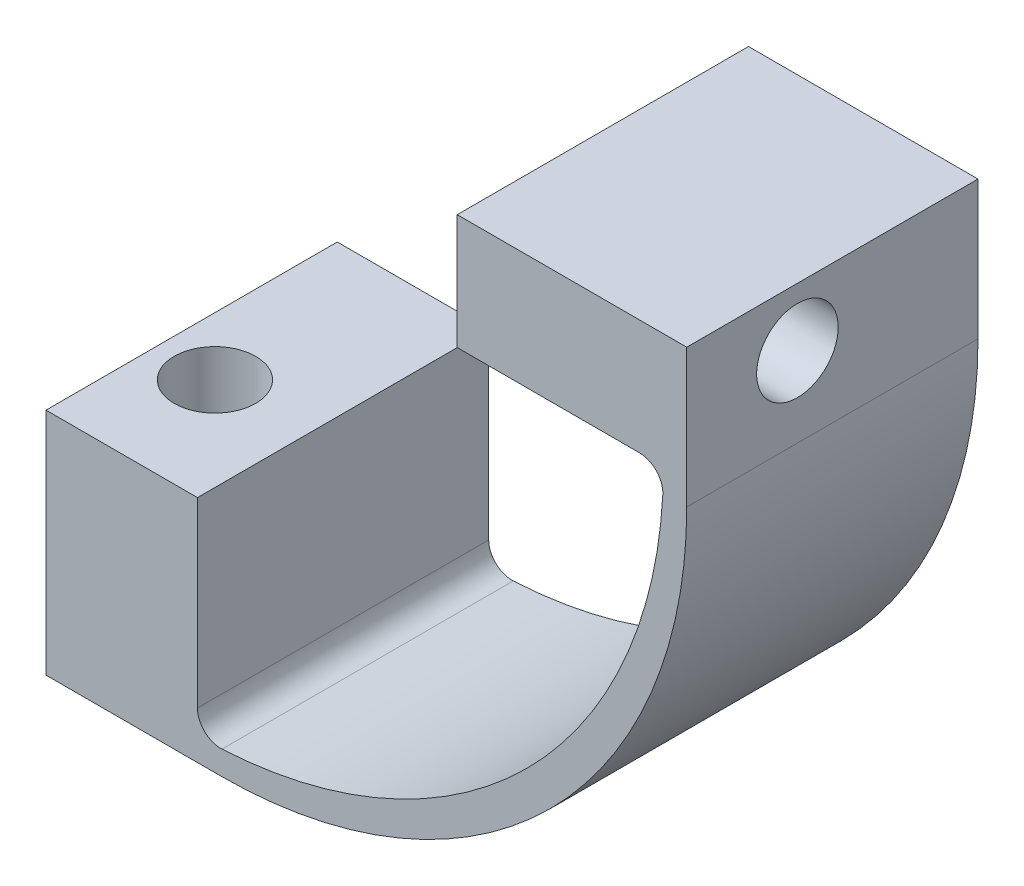
ISO-10303-21;
HEADER;
FILE_DESCRIPTION(('STEP AP214'),'2;1');
FILE_NAME('part.step','',(''),(''),'','','');
FILE_SCHEMA(('AUTOMOTIVE_DESIGN { 1 0 10303 214 1 1 1 1 }'));
ENDSEC;
DATA;
#1=APPLICATION_CONTEXT('core data for automotive mechanical design processes');
#2=APPLICATION_PROTOCOL_DEFINITION('international standard','automotive_design',2000,#1);
#3=PRODUCT_CONTEXT('',#1,'mechanical');
#4=PRODUCT('Part','Part','',(#3));
#5=PRODUCT_RELATED_PRODUCT_CATEGORY('part','',(#4));
#6=PRODUCT_DEFINITION_FORMATION('','',#4);
#7=PRODUCT_DEFINITION_CONTEXT('part definition',#1,'design');
#8=PRODUCT_DEFINITION('design','',#6,#7);
#9=PRODUCT_DEFINITION_SHAPE('','',#8);
#10=(LENGTH_UNIT() NAMED_UNIT(*) SI_UNIT(.MILLI.,.METRE.));
#11=(NAMED_UNIT(*) PLANE_ANGLE_UNIT() SI_UNIT($,.RADIAN.));
#12=(NAMED_UNIT(*) SI_UNIT($,.STERADIAN.) SOLID_ANGLE_UNIT());
#13=UNCERTAINTY_MEASURE_WITH_UNIT(LENGTH_MEASURE(1.E-05),#10,'distance_accuracy_value','');
#14=(GEOMETRIC_REPRESENTATION_CONTEXT(3) GLOBAL_UNCERTAINTY_ASSIGNED_CONTEXT((#13)) GLOBAL_UNIT_ASSIGNED_CONTEXT((#10,
#11,#12)) REPRESENTATION_CONTEXT('',''));
#15=CARTESIAN_POINT('',(0.,0.,0.));
#16=DIRECTION('',(0.,0.,1.));
#17=DIRECTION('',(1.,0.,0.));
#18=AXIS2_PLACEMENT_3D('',#15,#16,#17);
#19=CARTESIAN_POINT('',(0.,0.,0.));
#20=DIRECTION('',(0.,-1.,0.));
#21=DIRECTION('',(0.,0.,-1.));
#22=AXIS2_PLACEMENT_3D('',#19,#20,#21);
#23=PLANE('',#22);
#24=DIRECTION('',(-1.,0.,0.));
#25=VECTOR('',#24,1.);
#26=CARTESIAN_POINT('',(50.,0.,-15.5));
#27=LINE('',#26,#25);
#28=CARTESIAN_POINT('',(10.,0.,-15.5));
#29=VERTEX_POINT('',#28);
#30=CARTESIAN_POINT('',(-5.,0.,-15.5));
#31=VERTEX_POINT('',#30);
#32=EDGE_CURVE('E187',#29,#31,#27,.T.);
#33=ORIENTED_EDGE('',*,*,#32,.F.);
#34=DIRECTION('',(0.,0.,-1.));
#35=VECTOR('',#34,1.);
#36=CARTESIAN_POINT('',(10.,0.,9.49999999999999));
#37=LINE('',#36,#35);
#38=CARTESIAN_POINT('',(10.,0.,9.5));
#39=VERTEX_POINT('',#38);
#40=EDGE_CURVE('E208',#29,#39,#37,.F.);
#41=ORIENTED_EDGE('',*,*,#40,.T.);
#42=DIRECTION('',(1.,0.,0.));
#43=VECTOR('',#42,1.);
#44=CARTESIAN_POINT('',(50.,0.,9.49999999999999));
#45=LINE('',#44,#43);
#46=CARTESIAN_POINT('',(-5.,0.,9.5));
#47=VERTEX_POINT('',#46);
#48=EDGE_CURVE('E191',#47,#39,#45,.T.);
#49=ORIENTED_EDGE('',*,*,#48,.F.);
#50=DIRECTION('',(0.,0.,1.));
#51=VECTOR('',#50,1.);
#52=CARTESIAN_POINT('',(-5.,0.,-15.5));
#53=LINE('',#52,#51);
#54=EDGE_CURVE('E189',#31,#47,#53,.T.);
#55=ORIENTED_EDGE('',*,*,#54,.F.);
#56=EDGE_LOOP('',(#33,#41,#49,#55));
#57=FACE_BOUND('',#56,.T.);
#58=CARTESIAN_POINT('',(0.,0.,0.));
#59=DIRECTION('',(0.,1.,0.));
#60=DIRECTION('',(0.,0.,1.));
#61=AXIS2_PLACEMENT_3D('',#58,#59,#60);
#62=CIRCLE('',#61,3.5);
#63=CARTESIAN_POINT('',(0.,0.,3.5));
#64=VERTEX_POINT('',#63);
#65=EDGE_CURVE('E183',#64,#64,#62,.T.);
#66=ORIENTED_EDGE('',*,*,#65,.T.);
#67=EDGE_LOOP('',(#66));
#68=FACE_BOUND('',#67,.T.);
#69=ADVANCED_FACE('F35',(#57,#68),#23,.T.);
#70=CARTESIAN_POINT('',(50.,2.,-15.5));
#71=DIRECTION('',(-1.,0.,0.));
#72=DIRECTION('',(0.,0.,1.));
#73=AXIS2_PLACEMENT_3D('',#70,#71,#72);
#74=PLANE('',#73);
#75=DIRECTION('',(0.,-1.,0.));
#76=VECTOR('',#75,1.);
#77=CARTESIAN_POINT('',(50.,2.,9.49999999999999));
#78=LINE('',#77,#76);
#79=CARTESIAN_POINT('',(50.,51.88,9.5));
#80=VERTEX_POINT('',#79);
#81=CARTESIAN_POINT('',(50.,40.,9.49999999999999));
#82=VERTEX_POINT('',#81);
#83=EDGE_CURVE('E194',#80,#82,#78,.T.);
#84=ORIENTED_EDGE('',*,*,#83,.T.);
#85=DIRECTION('',(0.,0.,-1.));
#86=VECTOR('',#85,1.);
#87=CARTESIAN_POINT('',(50.,40.,-15.5));
#88=LINE('',#87,#86);
#89=CARTESIAN_POINT('',(50.,40.,-15.5));
#90=VERTEX_POINT('',#89);
#91=EDGE_CURVE('E205',#82,#90,#88,.T.);
#92=ORIENTED_EDGE('',*,*,#91,.T.);
#93=DIRECTION('',(0.,-1.,0.));
#94=VECTOR('',#93,1.);
#95=CARTESIAN_POINT('',(50.,2.,-15.5));
#96=LINE('',#95,#94);
#97=CARTESIAN_POINT('',(50.,51.88,-15.5));
#98=VERTEX_POINT('',#97);
#99=EDGE_CURVE('E203',#98,#90,#96,.T.);
#100=ORIENTED_EDGE('',*,*,#99,.F.);
#101=DIRECTION('',(0.,0.,1.));
#102=VECTOR('',#101,1.);
#103=CARTESIAN_POINT('',(50.,51.88,9.5));
#104=LINE('',#103,#102);
#105=EDGE_CURVE('E176',#98,#80,#104,.T.);
#106=ORIENTED_EDGE('',*,*,#105,.T.);
#107=EDGE_LOOP('',(#84,#92,#100,#106));
#108=FACE_BOUND('',#107,.T.);
#109=CARTESIAN_POINT('',(50.,46.88,0.));
#110=DIRECTION('',(1.,0.,0.));
#111=DIRECTION('',(0.,0.,-1.));
#112=AXIS2_PLACEMENT_3D('',#109,#110,#111);
#113=CIRCLE('',#112,3.5);
#114=CARTESIAN_POINT('',(50.,46.88,-3.5));
#115=VERTEX_POINT('',#114);
#116=EDGE_CURVE('E173',#115,#115,#113,.T.);
#117=ORIENTED_EDGE('',*,*,#116,.F.);
#118=EDGE_LOOP('',(#117));
#119=FACE_BOUND('',#118,.T.);
#120=ADVANCED_FACE('F256',(#108,#119),#74,.F.);
#121=CARTESIAN_POINT('',(50.,2.,-15.5));
#122=DIRECTION('',(0.,0.,1.));
#123=DIRECTION('',(1.,0.,0.));
#124=AXIS2_PLACEMENT_3D('',#121,#122,#123);
#125=PLANE('',#124);
#126=ORIENTED_EDGE('',*,*,#99,.T.);
#127=CARTESIAN_POINT('',(10.,40.,-15.5));
#128=DIRECTION('',(0.,0.,1.));
#129=DIRECTION('',(1.,0.,0.));
#130=AXIS2_PLACEMENT_3D('',#127,#128,#129);
#131=CIRCLE('',#130,40.);
#132=EDGE_CURVE('E214',#90,#29,#131,.F.);
#133=ORIENTED_EDGE('',*,*,#132,.T.);
#134=ORIENTED_EDGE('',*,*,#32,.T.);
#135=DIRECTION('',(0.,-1.,0.));
#136=VECTOR('',#135,1.);
#137=CARTESIAN_POINT('',(-5.,2.,-15.5));
#138=LINE('',#137,#136);
#139=CARTESIAN_POINT('',(-5.,19.7,-15.5));
#140=VERTEX_POINT('',#139);
#141=EDGE_CURVE('E200',#140,#31,#138,.T.);
#142=ORIENTED_EDGE('',*,*,#141,.F.);
#143=DIRECTION('',(-1.,0.,0.));
#144=VECTOR('',#143,1.);
#145=CARTESIAN_POINT('',(-5.,19.7,-15.5));
#146=LINE('',#145,#144);
#147=CARTESIAN_POINT('',(8.,19.7,-15.5));
#148=VERTEX_POINT('',#147);
#149=EDGE_CURVE('E165',#148,#140,#146,.T.);
#150=ORIENTED_EDGE('',*,*,#149,.F.);
#151=DIRECTION('',(0.,-1.,0.));
#152=VECTOR('',#151,1.);
#153=CARTESIAN_POINT('',(8.,19.7,-15.5));
#154=LINE('',#153,#152);
#155=CARTESIAN_POINT('',(8.,4.05266807797945,-15.5));
#156=VERTEX_POINT('',#155);
#157=EDGE_CURVE('E168',#148,#156,#154,.T.);
#158=ORIENTED_EDGE('',*,*,#157,.T.);
#159=CARTESIAN_POINT('',(10.,4.05266807797945,-15.5));
#160=DIRECTION('',(0.,0.,1.));
#161=DIRECTION('',(1.,0.,0.));
#162=AXIS2_PLACEMENT_3D('',#159,#160,#161);
#163=CIRCLE('',#162,2.);
#164=CARTESIAN_POINT('',(10.1052631578947,2.05544008208363,-15.5));
#165=VERTEX_POINT('',#164);
#166=EDGE_CURVE('E43',#156,#165,#163,.T.);
#167=ORIENTED_EDGE('',*,*,#166,.T.);
#168=CARTESIAN_POINT('',(8.,42.,-15.5));
#169=DIRECTION('',(0.,0.,1.));
#170=DIRECTION('',(1.,0.,0.));
#171=AXIS2_PLACEMENT_3D('',#168,#169,#170);
#172=CIRCLE('',#171,40.);
#173=CARTESIAN_POINT('',(47.9445599179164,39.8947368421053,-15.5));
#174=VERTEX_POINT('',#173);
#175=EDGE_CURVE('E210',#165,#174,#172,.T.);
#176=ORIENTED_EDGE('',*,*,#175,.T.);
#177=CARTESIAN_POINT('',(45.9473319220206,40.,-15.5));
#178=DIRECTION('',(0.,0.,1.));
#179=DIRECTION('',(1.,0.,0.));
#180=AXIS2_PLACEMENT_3D('',#177,#178,#179);
#181=CIRCLE('',#180,2.);
#182=CARTESIAN_POINT('',(45.9473319220206,42.,-15.5));
#183=VERTEX_POINT('',#182);
#184=EDGE_CURVE('E150',#174,#183,#181,.T.);
#185=ORIENTED_EDGE('',*,*,#184,.T.);
#186=DIRECTION('',(1.,0.,0.));
#187=VECTOR('',#186,1.);
#188=CARTESIAN_POINT('',(30.3,42.,-15.5));
#189=LINE('',#188,#187);
#190=CARTESIAN_POINT('',(30.3,42.,-15.5));
#191=VERTEX_POINT('',#190);
#192=EDGE_CURVE('E128',#191,#183,#189,.T.);
#193=ORIENTED_EDGE('',*,*,#192,.F.);
#194=DIRECTION('',(0.,-1.,0.));
#195=VECTOR('',#194,1.);
#196=CARTESIAN_POINT('',(30.3,51.88,-15.5));
#197=LINE('',#196,#195);
#198=CARTESIAN_POINT('',(30.3,51.88,-15.5));
#199=VERTEX_POINT('',#198);
#200=EDGE_CURVE('E136',#199,#191,#197,.T.);
#201=ORIENTED_EDGE('',*,*,#200,.F.);
#202=DIRECTION('',(1.,0.,0.));
#203=VECTOR('',#202,1.);
#204=CARTESIAN_POINT('',(48.,51.88,-15.5));
#205=LINE('',#204,#203);
#206=EDGE_CURVE('E179',#199,#98,#205,.T.);
#207=ORIENTED_EDGE('',*,*,#206,.T.);
#208=EDGE_LOOP('',(#126,#133,#134,#142,#150,#158,#167,#176,#185,#193,#201,#207));
#209=FACE_BOUND('',#208,.T.);
#210=ADVANCED_FACE('F148',(#209),#125,.F.);
#211=CARTESIAN_POINT('',(-5.,2.,-15.5));
#212=DIRECTION('',(1.,0.,0.));
#213=DIRECTION('',(0.,0.,-1.));
#214=AXIS2_PLACEMENT_3D('',#211,#212,#213);
#215=PLANE('',#214);
#216=ORIENTED_EDGE('',*,*,#54,.T.);
#217=DIRECTION('',(0.,-1.,0.));
#218=VECTOR('',#217,1.);
#219=CARTESIAN_POINT('',(-5.,2.,9.5));
#220=LINE('',#219,#218);
#221=CARTESIAN_POINT('',(-5.,19.7,9.5));
#222=VERTEX_POINT('',#221);
#223=EDGE_CURVE('E197',#222,#47,#220,.T.);
#224=ORIENTED_EDGE('',*,*,#223,.F.);
#225=DIRECTION('',(0.,0.,1.));
#226=VECTOR('',#225,1.);
#227=CARTESIAN_POINT('',(-5.,19.7,-15.5));
#228=LINE('',#227,#226);
#229=EDGE_CURVE('E154',#140,#222,#228,.T.);
#230=ORIENTED_EDGE('',*,*,#229,.F.);
#231=ORIENTED_EDGE('',*,*,#141,.T.);
#232=EDGE_LOOP('',(#216,#224,#230,#231));
#233=FACE_BOUND('',#232,.T.);
#234=ADVANCED_FACE('F243',(#233),#215,.F.);
#235=CARTESIAN_POINT('',(50.,2.,9.49999999999999));
#236=DIRECTION('',(0.,0.,-1.));
#237=DIRECTION('',(-1.,0.,0.));
#238=AXIS2_PLACEMENT_3D('',#235,#236,#237);
#239=PLANE('',#238);
#240=ORIENTED_EDGE('',*,*,#48,.T.);
#241=CARTESIAN_POINT('',(10.,40.,9.5));
#242=DIRECTION('',(0.,0.,-1.));
#243=DIRECTION('',(-1.,0.,0.));
#244=AXIS2_PLACEMENT_3D('',#241,#242,#243);
#245=CIRCLE('',#244,40.);
#246=EDGE_CURVE('E216',#39,#82,#245,.F.);
#247=ORIENTED_EDGE('',*,*,#246,.T.);
#248=ORIENTED_EDGE('',*,*,#83,.F.);
#249=DIRECTION('',(1.,0.,0.));
#250=VECTOR('',#249,1.);
#251=CARTESIAN_POINT('',(48.,51.88,9.5));
#252=LINE('',#251,#250);
#253=CARTESIAN_POINT('',(30.3,51.88,9.5));
#254=VERTEX_POINT('',#253);
#255=EDGE_CURVE('E180',#254,#80,#252,.T.);
#256=ORIENTED_EDGE('',*,*,#255,.F.);
#257=DIRECTION('',(0.,1.,0.));
#258=VECTOR('',#257,1.);
#259=CARTESIAN_POINT('',(30.3,51.88,9.5));
#260=LINE('',#259,#258);
#261=CARTESIAN_POINT('',(30.3,42.,9.5));
#262=VERTEX_POINT('',#261);
#263=EDGE_CURVE('E135',#262,#254,#260,.T.);
#264=ORIENTED_EDGE('',*,*,#263,.F.);
#265=DIRECTION('',(1.,0.,0.));
#266=VECTOR('',#265,1.);
#267=CARTESIAN_POINT('',(30.3,42.,9.5));
#268=LINE('',#267,#266);
#269=CARTESIAN_POINT('',(45.9473319220206,42.,9.5));
#270=VERTEX_POINT('',#269);
#271=EDGE_CURVE('E131',#262,#270,#268,.T.);
#272=ORIENTED_EDGE('',*,*,#271,.T.);
#273=CARTESIAN_POINT('',(45.9473319220206,40.,9.49999999999999));
#274=DIRECTION('',(0.,0.,-1.));
#275=DIRECTION('',(-1.,0.,0.));
#276=AXIS2_PLACEMENT_3D('',#273,#274,#275);
#277=CIRCLE('',#276,2.);
#278=CARTESIAN_POINT('',(47.9445599179164,39.8947368421053,9.49999999999999));
#279=VERTEX_POINT('',#278);
#280=EDGE_CURVE('E223',#270,#279,#277,.T.);
#281=ORIENTED_EDGE('',*,*,#280,.T.);
#282=CARTESIAN_POINT('',(8.,42.,9.5));
#283=DIRECTION('',(0.,0.,-1.));
#284=DIRECTION('',(-1.,0.,0.));
#285=AXIS2_PLACEMENT_3D('',#282,#283,#284);
#286=CIRCLE('',#285,40.);
#287=CARTESIAN_POINT('',(10.1052631578947,2.05544008208363,9.5));
#288=VERTEX_POINT('',#287);
#289=EDGE_CURVE('E212',#279,#288,#286,.T.);
#290=ORIENTED_EDGE('',*,*,#289,.T.);
#291=CARTESIAN_POINT('',(10.,4.05266807797945,9.5));
#292=DIRECTION('',(0.,0.,-1.));
#293=DIRECTION('',(-1.,0.,0.));
#294=AXIS2_PLACEMENT_3D('',#291,#292,#293);
#295=CIRCLE('',#294,2.);
#296=CARTESIAN_POINT('',(8.,4.05266807797945,9.5));
#297=VERTEX_POINT('',#296);
#298=EDGE_CURVE('E11',#288,#297,#295,.T.);
#299=ORIENTED_EDGE('',*,*,#298,.T.);
#300=DIRECTION('',(0.,-1.,0.));
#301=VECTOR('',#300,1.);
#302=CARTESIAN_POINT('',(8.,19.7,9.5));
#303=LINE('',#302,#301);
#304=CARTESIAN_POINT('',(8.,19.7,9.5));
#305=VERTEX_POINT('',#304);
#306=EDGE_CURVE('E170',#305,#297,#303,.T.);
#307=ORIENTED_EDGE('',*,*,#306,.F.);
#308=DIRECTION('',(1.,0.,0.));
#309=VECTOR('',#308,1.);
#310=CARTESIAN_POINT('',(-5.,19.7,9.5));
#311=LINE('',#310,#309);
#312=EDGE_CURVE('E161',#222,#305,#311,.T.);
#313=ORIENTED_EDGE('',*,*,#312,.F.);
#314=ORIENTED_EDGE('',*,*,#223,.T.);
#315=EDGE_LOOP('',(#240,#247,#248,#256,#264,#272,#281,#290,#299,#307,#313,#314));
#316=FACE_BOUND('',#315,.T.);
#317=ADVANCED_FACE('F248',(#316),#239,.F.);
#318=CARTESIAN_POINT('',(0.,2.,0.));
#319=DIRECTION('',(0.,-1.,0.));
#320=DIRECTION('',(0.,0.,-1.));
#321=AXIS2_PLACEMENT_3D('',#318,#319,#320);
#322=CYLINDRICAL_SURFACE('',#321,3.5);
#323=ORIENTED_EDGE('',*,*,#65,.F.);
#324=EDGE_LOOP('',(#323));
#325=FACE_BOUND('',#324,.T.);
#326=CARTESIAN_POINT('',(0.,19.7,0.));
#327=DIRECTION('',(0.,1.,0.));
#328=DIRECTION('',(0.,0.,1.));
#329=AXIS2_PLACEMENT_3D('',#326,#327,#328);
#330=CIRCLE('',#329,3.5);
#331=CARTESIAN_POINT('',(0.,19.7,3.5));
#332=VERTEX_POINT('',#331);
#333=EDGE_CURVE('E151',#332,#332,#330,.T.);
#334=ORIENTED_EDGE('',*,*,#333,.T.);
#335=EDGE_LOOP('',(#334));
#336=FACE_BOUND('',#335,.T.);
#337=ADVANCED_FACE('F268',(#325,#336),#322,.F.);
#338=CARTESIAN_POINT('',(48.,51.88,9.5));
#339=DIRECTION('',(0.,1.,0.));
#340=DIRECTION('',(0.,0.,1.));
#341=AXIS2_PLACEMENT_3D('',#338,#339,#340);
#342=PLANE('',#341);
#343=ORIENTED_EDGE('',*,*,#105,.F.);
#344=ORIENTED_EDGE('',*,*,#206,.F.);
#345=DIRECTION('',(0.,0.,-1.));
#346=VECTOR('',#345,1.);
#347=CARTESIAN_POINT('',(30.3,51.88,-15.5));
#348=LINE('',#347,#346);
#349=EDGE_CURVE('E143',#254,#199,#348,.T.);
#350=ORIENTED_EDGE('',*,*,#349,.F.);
#351=ORIENTED_EDGE('',*,*,#255,.T.);
#352=EDGE_LOOP('',(#343,#344,#350,#351));
#353=FACE_BOUND('',#352,.T.);
#354=ADVANCED_FACE('F303',(#353),#342,.T.);
#355=CARTESIAN_POINT('',(48.,46.88,0.));
#356=DIRECTION('',(1.,0.,0.));
#357=DIRECTION('',(0.,0.,-1.));
#358=AXIS2_PLACEMENT_3D('',#355,#356,#357);
#359=CYLINDRICAL_SURFACE('',#358,3.5);
#360=ORIENTED_EDGE('',*,*,#116,.T.);
#361=EDGE_LOOP('',(#360));
#362=FACE_BOUND('',#361,.T.);
#363=CARTESIAN_POINT('',(30.3,46.88,0.));
#364=DIRECTION('',(-1.,0.,0.));
#365=DIRECTION('',(0.,0.,1.));
#366=AXIS2_PLACEMENT_3D('',#363,#364,#365);
#367=CIRCLE('',#366,3.5);
#368=CARTESIAN_POINT('',(30.3,46.88,3.5));
#369=VERTEX_POINT('',#368);
#370=EDGE_CURVE('E145',#369,#369,#367,.T.);
#371=ORIENTED_EDGE('',*,*,#370,.T.);
#372=EDGE_LOOP('',(#371));
#373=FACE_BOUND('',#372,.T.);
#374=ADVANCED_FACE('F280',(#362,#373),#359,.F.);
#375=CARTESIAN_POINT('',(10.,40.,-15.5));
#376=DIRECTION('',(0.,0.,1.));
#377=DIRECTION('',(1.,0.,0.));
#378=AXIS2_PLACEMENT_3D('',#375,#376,#377);
#379=CYLINDRICAL_SURFACE('',#378,40.);
#380=ORIENTED_EDGE('',*,*,#246,.F.);
#381=ORIENTED_EDGE('',*,*,#40,.F.);
#382=ORIENTED_EDGE('',*,*,#132,.F.);
#383=ORIENTED_EDGE('',*,*,#91,.F.);
#384=EDGE_LOOP('',(#380,#381,#382,#383));
#385=FACE_BOUND('',#384,.T.);
#386=ADVANCED_FACE('F276',(#385),#379,.T.);
#387=CARTESIAN_POINT('',(8.,42.,0.));
#388=DIRECTION('',(0.,0.,-1.));
#389=DIRECTION('',(-1.,0.,0.));
#390=AXIS2_PLACEMENT_3D('',#387,#388,#389);
#391=CYLINDRICAL_SURFACE('',#390,40.);
#392=ORIENTED_EDGE('',*,*,#175,.F.);
#393=DIRECTION('',(0.,0.,-1.));
#394=VECTOR('',#393,1.);
#395=CARTESIAN_POINT('',(10.1052631578947,2.05544008208363,0.));
#396=LINE('',#395,#394);
#397=EDGE_CURVE('E56',#165,#288,#396,.F.);
#398=ORIENTED_EDGE('',*,*,#397,.T.);
#399=ORIENTED_EDGE('',*,*,#289,.F.);
#400=DIRECTION('',(0.,0.,-1.));
#401=VECTOR('',#400,1.);
#402=CARTESIAN_POINT('',(47.9445599179164,39.8947368421053,0.));
#403=LINE('',#402,#401);
#404=EDGE_CURVE('E220',#279,#174,#403,.T.);
#405=ORIENTED_EDGE('',*,*,#404,.T.);
#406=EDGE_LOOP('',(#392,#398,#399,#405));
#407=FACE_BOUND('',#406,.T.);
#408=ADVANCED_FACE('F279',(#407),#391,.F.);
#409=CARTESIAN_POINT('',(0.,19.7,0.));
#410=DIRECTION('',(0.,1.,0.));
#411=DIRECTION('',(0.,0.,1.));
#412=AXIS2_PLACEMENT_3D('',#409,#410,#411);
#413=PLANE('',#412);
#414=ORIENTED_EDGE('',*,*,#229,.T.);
#415=ORIENTED_EDGE('',*,*,#312,.T.);
#416=DIRECTION('',(0.,0.,-1.));
#417=VECTOR('',#416,1.);
#418=CARTESIAN_POINT('',(8.,19.7,-15.5));
#419=LINE('',#418,#417);
#420=EDGE_CURVE('E163',#305,#148,#419,.T.);
#421=ORIENTED_EDGE('',*,*,#420,.T.);
#422=ORIENTED_EDGE('',*,*,#149,.T.);
#423=EDGE_LOOP('',(#414,#415,#421,#422));
#424=FACE_BOUND('',#423,.T.);
#425=ORIENTED_EDGE('',*,*,#333,.F.);
#426=EDGE_LOOP('',(#425));
#427=FACE_BOUND('',#426,.T.);
#428=ADVANCED_FACE('F240',(#424,#427),#413,.T.);
#429=CARTESIAN_POINT('',(8.,19.7,-15.5));
#430=DIRECTION('',(-1.,0.,0.));
#431=DIRECTION('',(0.,0.,1.));
#432=AXIS2_PLACEMENT_3D('',#429,#430,#431);
#433=PLANE('',#432);
#434=ORIENTED_EDGE('',*,*,#306,.T.);
#435=DIRECTION('',(0.,0.,1.));
#436=VECTOR('',#435,1.);
#437=CARTESIAN_POINT('',(8.,4.05266807797945,-15.5));
#438=LINE('',#437,#436);
#439=EDGE_CURVE('E226',#297,#156,#438,.F.);
#440=ORIENTED_EDGE('',*,*,#439,.T.);
#441=ORIENTED_EDGE('',*,*,#157,.F.);
#442=ORIENTED_EDGE('',*,*,#420,.F.);
#443=EDGE_LOOP('',(#434,#440,#441,#442));
#444=FACE_BOUND('',#443,.T.);
#445=ADVANCED_FACE('F232',(#444),#433,.F.);
#446=CARTESIAN_POINT('',(30.3,0.,0.));
#447=DIRECTION('',(-1.,0.,0.));
#448=DIRECTION('',(0.,0.,1.));
#449=AXIS2_PLACEMENT_3D('',#446,#447,#448);
#450=PLANE('',#449);
#451=ORIENTED_EDGE('',*,*,#200,.T.);
#452=DIRECTION('',(0.,0.,1.));
#453=VECTOR('',#452,1.);
#454=CARTESIAN_POINT('',(30.3,42.,-15.5));
#455=LINE('',#454,#453);
#456=EDGE_CURVE('E123',#191,#262,#455,.T.);
#457=ORIENTED_EDGE('',*,*,#456,.T.);
#458=ORIENTED_EDGE('',*,*,#263,.T.);
#459=ORIENTED_EDGE('',*,*,#349,.T.);
#460=EDGE_LOOP('',(#451,#457,#458,#459));
#461=FACE_BOUND('',#460,.T.);
#462=ORIENTED_EDGE('',*,*,#370,.F.);
#463=EDGE_LOOP('',(#462));
#464=FACE_BOUND('',#463,.T.);
#465=ADVANCED_FACE('F140',(#461,#464),#450,.T.);
#466=CARTESIAN_POINT('',(30.3,42.,-15.5));
#467=DIRECTION('',(0.,1.,0.));
#468=DIRECTION('',(0.,0.,1.));
#469=AXIS2_PLACEMENT_3D('',#466,#467,#468);
#470=PLANE('',#469);
#471=ORIENTED_EDGE('',*,*,#192,.T.);
#472=DIRECTION('',(0.,0.,1.));
#473=VECTOR('',#472,1.);
#474=CARTESIAN_POINT('',(45.9473319220206,42.,9.5));
#475=LINE('',#474,#473);
#476=EDGE_CURVE('E218',#183,#270,#475,.T.);
#477=ORIENTED_EDGE('',*,*,#476,.T.);
#478=ORIENTED_EDGE('',*,*,#271,.F.);
#479=ORIENTED_EDGE('',*,*,#456,.F.);
#480=EDGE_LOOP('',(#471,#477,#478,#479));
#481=FACE_BOUND('',#480,.T.);
#482=ADVANCED_FACE('F125',(#481),#470,.F.);
#483=CARTESIAN_POINT('',(45.9473319220206,40.,0.));
#484=DIRECTION('',(0.,0.,-1.));
#485=DIRECTION('',(-1.,0.,0.));
#486=AXIS2_PLACEMENT_3D('',#483,#484,#485);
#487=CYLINDRICAL_SURFACE('',#486,2.);
#488=ORIENTED_EDGE('',*,*,#184,.F.);
#489=ORIENTED_EDGE('',*,*,#404,.F.);
#490=ORIENTED_EDGE('',*,*,#280,.F.);
#491=ORIENTED_EDGE('',*,*,#476,.F.);
#492=EDGE_LOOP('',(#488,#489,#490,#491));
#493=FACE_BOUND('',#492,.T.);
#494=ADVANCED_FACE('F250',(#493),#487,.F.);
#495=CARTESIAN_POINT('',(10.,4.05266807797945,0.));
#496=DIRECTION('',(0.,0.,-1.));
#497=DIRECTION('',(-1.,0.,0.));
#498=AXIS2_PLACEMENT_3D('',#495,#496,#497);
#499=CYLINDRICAL_SURFACE('',#498,2.);
#500=ORIENTED_EDGE('',*,*,#298,.F.);
#501=ORIENTED_EDGE('',*,*,#397,.F.);
#502=ORIENTED_EDGE('',*,*,#166,.F.);
#503=ORIENTED_EDGE('',*,*,#439,.F.);
#504=EDGE_LOOP('',(#500,#501,#502,#503));
#505=FACE_BOUND('',#504,.T.);
#506=ADVANCED_FACE('F37',(#505),#499,.F.);
#507=CLOSED_SHELL('',(#69,#120,#210,#234,#317,#337,#354,#374,#386,#408,#428,#445,#465,#482,#494,#506));
#508=MANIFOLD_SOLID_BREP('B2',#507);
#509=ADVANCED_BREP_SHAPE_REPRESENTATION('',(#18,#508),#14);
#510=SHAPE_DEFINITION_REPRESENTATION(#9,#509);
ENDSEC;
END-ISO-10303-21;
